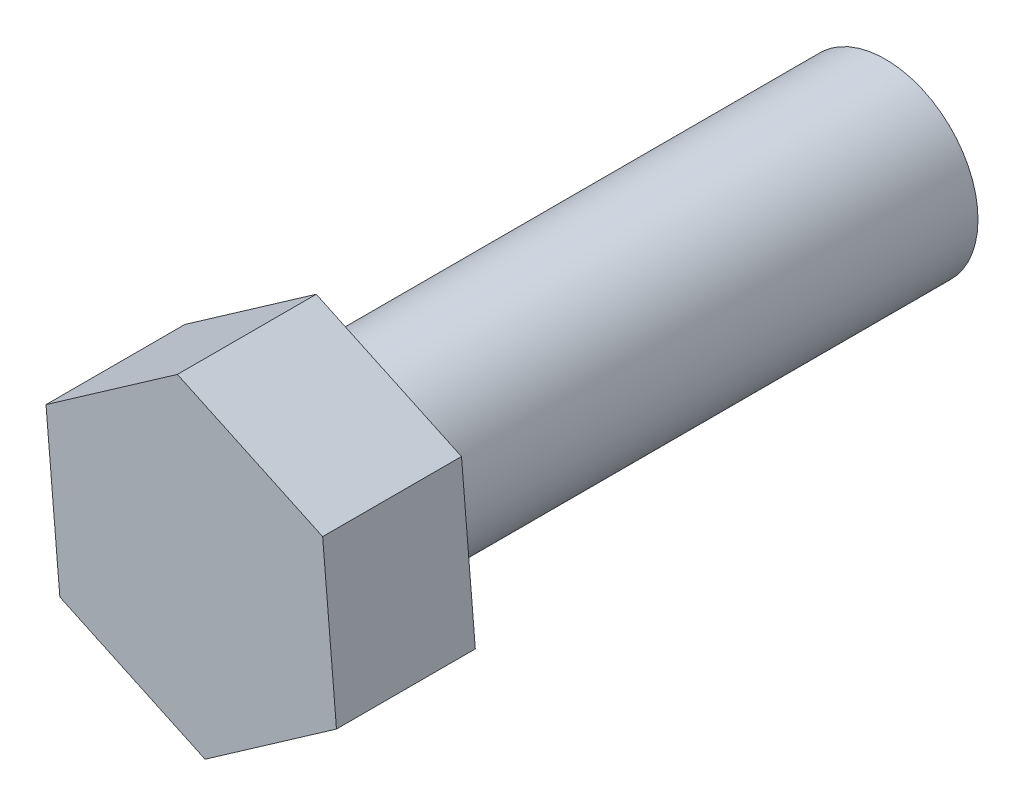
ISO-10303-21;
HEADER;
FILE_DESCRIPTION(('STEP AP214'),'2;1');
FILE_NAME('part.step','',(''),(''),'','','');
FILE_SCHEMA(('AUTOMOTIVE_DESIGN { 1 0 10303 214 1 1 1 1 }'));
ENDSEC;
DATA;
#1=APPLICATION_CONTEXT('core data for automotive mechanical design processes');
#2=APPLICATION_PROTOCOL_DEFINITION('international standard','automotive_design',2000,#1);
#3=PRODUCT_CONTEXT('',#1,'mechanical');
#4=PRODUCT('Part','Part','',(#3));
#5=PRODUCT_RELATED_PRODUCT_CATEGORY('part','',(#4));
#6=PRODUCT_DEFINITION_FORMATION('','',#4);
#7=PRODUCT_DEFINITION_CONTEXT('part definition',#1,'design');
#8=PRODUCT_DEFINITION('design','',#6,#7);
#9=PRODUCT_DEFINITION_SHAPE('','',#8);
#10=(LENGTH_UNIT() NAMED_UNIT(*) SI_UNIT(.MILLI.,.METRE.));
#11=(NAMED_UNIT(*) PLANE_ANGLE_UNIT() SI_UNIT($,.RADIAN.));
#12=(NAMED_UNIT(*) SI_UNIT($,.STERADIAN.) SOLID_ANGLE_UNIT());
#13=UNCERTAINTY_MEASURE_WITH_UNIT(LENGTH_MEASURE(1.E-05),#10,'distance_accuracy_value','');
#14=(GEOMETRIC_REPRESENTATION_CONTEXT(3) GLOBAL_UNCERTAINTY_ASSIGNED_CONTEXT((#13)) GLOBAL_UNIT_ASSIGNED_CONTEXT((#10,
#11,#12)) REPRESENTATION_CONTEXT('',''));
#15=CARTESIAN_POINT('',(0.,0.,0.));
#16=DIRECTION('',(0.,0.,1.));
#17=DIRECTION('',(1.,0.,0.));
#18=AXIS2_PLACEMENT_3D('',#15,#16,#17);
#19=CARTESIAN_POINT('',(0.299200271990682,-3.45115621165439,0.));
#20=DIRECTION('',(0.,0.,1.));
#21=DIRECTION('',(1.,0.,0.));
#22=AXIS2_PLACEMENT_3D('',#19,#20,#21);
#23=PLANE('',#22);
#24=DIRECTION('',(0.905974892307456,-0.423331423955858,0.));
#25=VECTOR('',#24,1.);
#26=CARTESIAN_POINT('',(-2.83918881572583,-1.98469314219034,0.));
#27=LINE('',#26,#25);
#28=CARTESIAN_POINT('',(-2.83918881572583,-1.98469314219034,0.));
#29=VERTEX_POINT('',#28);
#30=CARTESIAN_POINT('',(0.299200271990682,-3.45115621165439,0.));
#31=VERTEX_POINT('',#30);
#32=EDGE_CURVE('E117',#29,#31,#27,.T.);
#33=ORIENTED_EDGE('',*,*,#32,.F.);
#34=DIRECTION('',(0.0863716787877165,-0.996262983907056,0.));
#35=VECTOR('',#34,1.);
#36=CARTESIAN_POINT('',(-3.13838908771652,1.46646306946405,0.));
#37=LINE('',#36,#35);
#38=CARTESIAN_POINT('',(-3.13838908771652,1.46646306946405,0.));
#39=VERTEX_POINT('',#38);
#40=EDGE_CURVE('E77',#39,#29,#37,.T.);
#41=ORIENTED_EDGE('',*,*,#40,.F.);
#42=DIRECTION('',(-0.819603213519741,-0.572931559951199,0.));
#43=VECTOR('',#42,1.);
#44=CARTESIAN_POINT('',(-0.299200271990682,3.45115621165439,0.));
#45=LINE('',#44,#43);
#46=CARTESIAN_POINT('',(-0.299200271990682,3.45115621165439,0.));
#47=VERTEX_POINT('',#46);
#48=EDGE_CURVE('E71',#47,#39,#45,.T.);
#49=ORIENTED_EDGE('',*,*,#48,.F.);
#50=DIRECTION('',(-0.905974892307456,0.423331423955857,0.));
#51=VECTOR('',#50,1.);
#52=CARTESIAN_POINT('',(2.83918881572583,1.98469314219034,0.));
#53=LINE('',#52,#51);
#54=CARTESIAN_POINT('',(2.83918881572583,1.98469314219034,0.));
#55=VERTEX_POINT('',#54);
#56=EDGE_CURVE('E107',#55,#47,#53,.T.);
#57=ORIENTED_EDGE('',*,*,#56,.F.);
#58=DIRECTION('',(-0.0863716787877153,0.996262983907056,0.));
#59=VECTOR('',#58,1.);
#60=CARTESIAN_POINT('',(3.13838908771651,-1.46646306946405,0.));
#61=LINE('',#60,#59);
#62=CARTESIAN_POINT('',(3.13838908771651,-1.46646306946405,0.));
#63=VERTEX_POINT('',#62);
#64=EDGE_CURVE('E123',#63,#55,#61,.T.);
#65=ORIENTED_EDGE('',*,*,#64,.F.);
#66=DIRECTION('',(0.819603213519741,0.572931559951199,0.));
#67=VECTOR('',#66,1.);
#68=CARTESIAN_POINT('',(0.299200271990682,-3.45115621165439,0.));
#69=LINE('',#68,#67);
#70=EDGE_CURVE('E120',#31,#63,#69,.T.);
#71=ORIENTED_EDGE('',*,*,#70,.F.);
#72=EDGE_LOOP('',(#33,#41,#49,#57,#65,#71));
#73=FACE_BOUND('',#72,.T.);
#74=CARTESIAN_POINT('',(0.,0.,0.));
#75=DIRECTION('',(0.,0.,1.));
#76=DIRECTION('',(1.,0.,0.));
#77=AXIS2_PLACEMENT_3D('',#74,#75,#76);
#78=CIRCLE('',#77,2.);
#79=CARTESIAN_POINT('',(2.,0.,0.));
#80=VERTEX_POINT('',#79);
#81=EDGE_CURVE('E11',#80,#80,#78,.F.);
#82=ORIENTED_EDGE('',*,*,#81,.F.);
#83=EDGE_LOOP('',(#82));
#84=FACE_BOUND('',#83,.T.);
#85=ADVANCED_FACE('F31',(#73,#84),#23,.F.);
#86=CARTESIAN_POINT('',(-2.83918881572583,-1.98469314219034,3.));
#87=DIRECTION('',(0.423331423955858,0.905974892307456,0.));
#88=DIRECTION('',(-0.905974892307456,0.423331423955858,0.));
#89=AXIS2_PLACEMENT_3D('',#86,#87,#88);
#90=PLANE('',#89);
#91=ORIENTED_EDGE('',*,*,#32,.T.);
#92=DIRECTION('',(0.,0.,-1.));
#93=VECTOR('',#92,1.);
#94=CARTESIAN_POINT('',(0.299200271990682,-3.45115621165439,3.));
#95=LINE('',#94,#93);
#96=CARTESIAN_POINT('',(0.299200271990682,-3.45115621165439,3.));
#97=VERTEX_POINT('',#96);
#98=EDGE_CURVE('E40',#97,#31,#95,.T.);
#99=ORIENTED_EDGE('',*,*,#98,.F.);
#100=DIRECTION('',(0.905974892307456,-0.423331423955858,0.));
#101=VECTOR('',#100,1.);
#102=CARTESIAN_POINT('',(-2.83918881572583,-1.98469314219034,3.));
#103=LINE('',#102,#101);
#104=CARTESIAN_POINT('',(-2.83918881572583,-1.98469314219034,3.));
#105=VERTEX_POINT('',#104);
#106=EDGE_CURVE('E128',#105,#97,#103,.T.);
#107=ORIENTED_EDGE('',*,*,#106,.F.);
#108=DIRECTION('',(0.,0.,-1.));
#109=VECTOR('',#108,1.);
#110=CARTESIAN_POINT('',(-2.83918881572583,-1.98469314219034,3.));
#111=LINE('',#110,#109);
#112=EDGE_CURVE('E113',#105,#29,#111,.T.);
#113=ORIENTED_EDGE('',*,*,#112,.T.);
#114=EDGE_LOOP('',(#91,#99,#107,#113));
#115=FACE_BOUND('',#114,.T.);
#116=ADVANCED_FACE('F33',(#115),#90,.F.);
#117=CARTESIAN_POINT('',(0.299200271990682,-3.45115621165439,3.));
#118=DIRECTION('',(-0.572931559951199,0.819603213519741,0.));
#119=DIRECTION('',(-0.819603213519741,-0.572931559951199,0.));
#120=AXIS2_PLACEMENT_3D('',#117,#118,#119);
#121=PLANE('',#120);
#122=ORIENTED_EDGE('',*,*,#70,.T.);
#123=DIRECTION('',(0.,0.,-1.));
#124=VECTOR('',#123,1.);
#125=CARTESIAN_POINT('',(3.13838908771651,-1.46646306946405,3.));
#126=LINE('',#125,#124);
#127=CARTESIAN_POINT('',(3.13838908771651,-1.46646306946405,3.));
#128=VERTEX_POINT('',#127);
#129=EDGE_CURVE('E132',#128,#63,#126,.T.);
#130=ORIENTED_EDGE('',*,*,#129,.F.);
#131=DIRECTION('',(0.819603213519741,0.572931559951199,0.));
#132=VECTOR('',#131,1.);
#133=CARTESIAN_POINT('',(0.299200271990682,-3.45115621165439,3.));
#134=LINE('',#133,#132);
#135=EDGE_CURVE('E86',#97,#128,#134,.T.);
#136=ORIENTED_EDGE('',*,*,#135,.F.);
#137=ORIENTED_EDGE('',*,*,#98,.T.);
#138=EDGE_LOOP('',(#122,#130,#136,#137));
#139=FACE_BOUND('',#138,.T.);
#140=ADVANCED_FACE('F135',(#139),#121,.F.);
#141=CARTESIAN_POINT('',(3.13838908771651,-1.46646306946405,3.));
#142=DIRECTION('',(-0.996262983907056,-0.0863716787877153,0.));
#143=DIRECTION('',(0.0863716787877153,-0.996262983907056,0.));
#144=AXIS2_PLACEMENT_3D('',#141,#142,#143);
#145=PLANE('',#144);
#146=ORIENTED_EDGE('',*,*,#64,.T.);
#147=DIRECTION('',(0.,0.,-1.));
#148=VECTOR('',#147,1.);
#149=CARTESIAN_POINT('',(2.83918881572583,1.98469314219034,3.));
#150=LINE('',#149,#148);
#151=CARTESIAN_POINT('',(2.83918881572583,1.98469314219034,3.));
#152=VERTEX_POINT('',#151);
#153=EDGE_CURVE('E108',#152,#55,#150,.T.);
#154=ORIENTED_EDGE('',*,*,#153,.F.);
#155=DIRECTION('',(-0.0863716787877153,0.996262983907056,0.));
#156=VECTOR('',#155,1.);
#157=CARTESIAN_POINT('',(3.13838908771651,-1.46646306946405,3.));
#158=LINE('',#157,#156);
#159=EDGE_CURVE('E99',#128,#152,#158,.T.);
#160=ORIENTED_EDGE('',*,*,#159,.F.);
#161=ORIENTED_EDGE('',*,*,#129,.T.);
#162=EDGE_LOOP('',(#146,#154,#160,#161));
#163=FACE_BOUND('',#162,.T.);
#164=ADVANCED_FACE('F143',(#163),#145,.F.);
#165=CARTESIAN_POINT('',(2.83918881572583,1.98469314219034,3.));
#166=DIRECTION('',(-0.423331423955857,-0.905974892307456,0.));
#167=DIRECTION('',(0.905974892307456,-0.423331423955857,0.));
#168=AXIS2_PLACEMENT_3D('',#165,#166,#167);
#169=PLANE('',#168);
#170=ORIENTED_EDGE('',*,*,#56,.T.);
#171=DIRECTION('',(0.,0.,-1.));
#172=VECTOR('',#171,1.);
#173=CARTESIAN_POINT('',(-0.299200271990682,3.45115621165439,3.));
#174=LINE('',#173,#172);
#175=CARTESIAN_POINT('',(-0.299200271990682,3.45115621165439,3.));
#176=VERTEX_POINT('',#175);
#177=EDGE_CURVE('E104',#176,#47,#174,.T.);
#178=ORIENTED_EDGE('',*,*,#177,.F.);
#179=DIRECTION('',(-0.905974892307456,0.423331423955857,0.));
#180=VECTOR('',#179,1.);
#181=CARTESIAN_POINT('',(2.83918881572583,1.98469314219034,3.));
#182=LINE('',#181,#180);
#183=EDGE_CURVE('E93',#152,#176,#182,.T.);
#184=ORIENTED_EDGE('',*,*,#183,.F.);
#185=ORIENTED_EDGE('',*,*,#153,.T.);
#186=EDGE_LOOP('',(#170,#178,#184,#185));
#187=FACE_BOUND('',#186,.T.);
#188=ADVANCED_FACE('F105',(#187),#169,.F.);
#189=CARTESIAN_POINT('',(-0.299200271990682,3.45115621165439,3.));
#190=DIRECTION('',(0.572931559951199,-0.819603213519741,0.));
#191=DIRECTION('',(0.819603213519741,0.572931559951199,0.));
#192=AXIS2_PLACEMENT_3D('',#189,#190,#191);
#193=PLANE('',#192);
#194=ORIENTED_EDGE('',*,*,#48,.T.);
#195=DIRECTION('',(0.,0.,-1.));
#196=VECTOR('',#195,1.);
#197=CARTESIAN_POINT('',(-3.13838908771652,1.46646306946405,3.));
#198=LINE('',#197,#196);
#199=CARTESIAN_POINT('',(-3.13838908771652,1.46646306946405,3.));
#200=VERTEX_POINT('',#199);
#201=EDGE_CURVE('E109',#200,#39,#198,.T.);
#202=ORIENTED_EDGE('',*,*,#201,.F.);
#203=DIRECTION('',(-0.819603213519741,-0.572931559951199,0.));
#204=VECTOR('',#203,1.);
#205=CARTESIAN_POINT('',(-0.299200271990682,3.45115621165439,3.));
#206=LINE('',#205,#204);
#207=EDGE_CURVE('E97',#176,#200,#206,.T.);
#208=ORIENTED_EDGE('',*,*,#207,.F.);
#209=ORIENTED_EDGE('',*,*,#177,.T.);
#210=EDGE_LOOP('',(#194,#202,#208,#209));
#211=FACE_BOUND('',#210,.T.);
#212=ADVANCED_FACE('F111',(#211),#193,.F.);
#213=CARTESIAN_POINT('',(-3.13838908771652,1.46646306946405,3.));
#214=DIRECTION('',(0.996262983907056,0.0863716787877165,0.));
#215=DIRECTION('',(-0.0863716787877165,0.996262983907056,0.));
#216=AXIS2_PLACEMENT_3D('',#213,#214,#215);
#217=PLANE('',#216);
#218=ORIENTED_EDGE('',*,*,#40,.T.);
#219=ORIENTED_EDGE('',*,*,#112,.F.);
#220=DIRECTION('',(0.0863716787877165,-0.996262983907056,0.));
#221=VECTOR('',#220,1.);
#222=CARTESIAN_POINT('',(-3.13838908771652,1.46646306946405,3.));
#223=LINE('',#222,#221);
#224=EDGE_CURVE('E48',#200,#105,#223,.T.);
#225=ORIENTED_EDGE('',*,*,#224,.F.);
#226=ORIENTED_EDGE('',*,*,#201,.T.);
#227=EDGE_LOOP('',(#218,#219,#225,#226));
#228=FACE_BOUND('',#227,.T.);
#229=ADVANCED_FACE('F164',(#228),#217,.F.);
#230=CARTESIAN_POINT('',(0.299200271990682,-3.45115621165439,3.));
#231=DIRECTION('',(0.,0.,1.));
#232=DIRECTION('',(1.,0.,0.));
#233=AXIS2_PLACEMENT_3D('',#230,#231,#232);
#234=PLANE('',#233);
#235=ORIENTED_EDGE('',*,*,#106,.T.);
#236=ORIENTED_EDGE('',*,*,#135,.T.);
#237=ORIENTED_EDGE('',*,*,#159,.T.);
#238=ORIENTED_EDGE('',*,*,#183,.T.);
#239=ORIENTED_EDGE('',*,*,#207,.T.);
#240=ORIENTED_EDGE('',*,*,#224,.T.);
#241=EDGE_LOOP('',(#235,#236,#237,#238,#239,#240));
#242=FACE_BOUND('',#241,.T.);
#243=ADVANCED_FACE('F95',(#242),#234,.T.);
#244=CARTESIAN_POINT('',(0.,0.,-12.));
#245=DIRECTION('',(0.,0.,1.));
#246=DIRECTION('',(1.,0.,0.));
#247=AXIS2_PLACEMENT_3D('',#244,#245,#246);
#248=CYLINDRICAL_SURFACE('',#247,2.);
#249=CARTESIAN_POINT('',(0.,0.,-12.));
#250=DIRECTION('',(0.,0.,-1.));
#251=DIRECTION('',(-1.,0.,0.));
#252=AXIS2_PLACEMENT_3D('',#249,#250,#251);
#253=CIRCLE('',#252,2.);
#254=CARTESIAN_POINT('',(-2.,0.,-12.));
#255=VERTEX_POINT('',#254);
#256=EDGE_CURVE('E121',#255,#255,#253,.T.);
#257=ORIENTED_EDGE('',*,*,#256,.F.);
#258=EDGE_LOOP('',(#257));
#259=FACE_BOUND('',#258,.T.);
#260=ORIENTED_EDGE('',*,*,#81,.T.);
#261=EDGE_LOOP('',(#260));
#262=FACE_BOUND('',#261,.T.);
#263=ADVANCED_FACE('F152',(#259,#262),#248,.T.);
#264=CARTESIAN_POINT('',(0.,0.,-12.));
#265=DIRECTION('',(0.,0.,-1.));
#266=DIRECTION('',(-1.,0.,0.));
#267=AXIS2_PLACEMENT_3D('',#264,#265,#266);
#268=PLANE('',#267);
#269=ORIENTED_EDGE('',*,*,#256,.T.);
#270=EDGE_LOOP('',(#269));
#271=FACE_BOUND('',#270,.T.);
#272=ADVANCED_FACE('F150',(#271),#268,.T.);
#273=CLOSED_SHELL('',(#85,#116,#140,#164,#188,#212,#229,#243,#263,#272));
#274=MANIFOLD_SOLID_BREP('B2',#273);
#275=ADVANCED_BREP_SHAPE_REPRESENTATION('',(#18,#274),#14);
#276=SHAPE_DEFINITION_REPRESENTATION(#9,#275);
ENDSEC;
END-ISO-10303-21;
